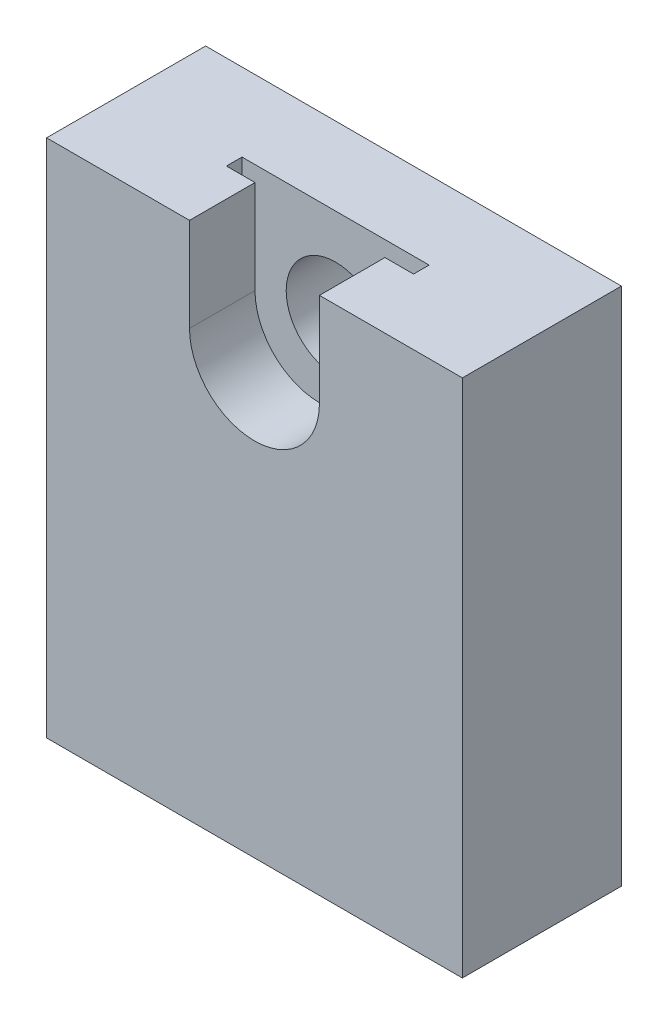
ISO-10303-21;
HEADER;
FILE_DESCRIPTION(('STEP AP214'),'2;1');
FILE_NAME('part.step','',(''),(''),'','','');
FILE_SCHEMA(('AUTOMOTIVE_DESIGN { 1 0 10303 214 1 1 1 1 }'));
ENDSEC;
DATA;
#1=APPLICATION_CONTEXT('core data for automotive mechanical design processes');
#2=APPLICATION_PROTOCOL_DEFINITION('international standard','automotive_design',2000,#1);
#3=PRODUCT_CONTEXT('',#1,'mechanical');
#4=PRODUCT('Part','Part','',(#3));
#5=PRODUCT_RELATED_PRODUCT_CATEGORY('part','',(#4));
#6=PRODUCT_DEFINITION_FORMATION('','',#4);
#7=PRODUCT_DEFINITION_CONTEXT('part definition',#1,'design');
#8=PRODUCT_DEFINITION('design','',#6,#7);
#9=PRODUCT_DEFINITION_SHAPE('','',#8);
#10=(LENGTH_UNIT() NAMED_UNIT(*) SI_UNIT(.MILLI.,.METRE.));
#11=(NAMED_UNIT(*) PLANE_ANGLE_UNIT() SI_UNIT($,.RADIAN.));
#12=(NAMED_UNIT(*) SI_UNIT($,.STERADIAN.) SOLID_ANGLE_UNIT());
#13=UNCERTAINTY_MEASURE_WITH_UNIT(LENGTH_MEASURE(1.E-05),#10,'distance_accuracy_value','');
#14=(GEOMETRIC_REPRESENTATION_CONTEXT(3) GLOBAL_UNCERTAINTY_ASSIGNED_CONTEXT((#13)) GLOBAL_UNIT_ASSIGNED_CONTEXT((#10,
#11,#12)) REPRESENTATION_CONTEXT('',''));
#15=CARTESIAN_POINT('',(0.,0.,0.));
#16=DIRECTION('',(0.,0.,1.));
#17=DIRECTION('',(1.,0.,0.));
#18=AXIS2_PLACEMENT_3D('',#15,#16,#17);
#19=CARTESIAN_POINT('',(20.,9.,-15.3));
#20=DIRECTION('',(0.,1.,0.));
#21=DIRECTION('',(-1.,0.,0.));
#22=AXIS2_PLACEMENT_3D('',#19,#20,#21);
#23=PLANE('',#22);
#24=DIRECTION('',(0.,0.,1.));
#25=VECTOR('',#24,1.);
#26=CARTESIAN_POINT('',(-9.,9.,-7.8));
#27=LINE('',#26,#25);
#28=CARTESIAN_POINT('',(-9.,9.,-7.8));
#29=VERTEX_POINT('',#28);
#30=CARTESIAN_POINT('',(-9.,9.,-6.3));
#31=VERTEX_POINT('',#30);
#32=EDGE_CURVE('E172',#29,#31,#27,.T.);
#33=ORIENTED_EDGE('',*,*,#32,.F.);
#34=DIRECTION('',(1.,0.,0.));
#35=VECTOR('',#34,1.);
#36=CARTESIAN_POINT('',(20.,9.,-7.8));
#37=LINE('',#36,#35);
#38=CARTESIAN_POINT('',(9.,9.,-7.8));
#39=VERTEX_POINT('',#38);
#40=EDGE_CURVE('E177',#29,#39,#37,.T.);
#41=ORIENTED_EDGE('',*,*,#40,.T.);
#42=DIRECTION('',(0.,0.,1.));
#43=VECTOR('',#42,1.);
#44=CARTESIAN_POINT('',(9.,9.,-7.8));
#45=LINE('',#44,#43);
#46=CARTESIAN_POINT('',(9.,9.,-6.3));
#47=VERTEX_POINT('',#46);
#48=EDGE_CURVE('E147',#39,#47,#45,.T.);
#49=ORIENTED_EDGE('',*,*,#48,.T.);
#50=DIRECTION('',(1.,0.,0.));
#51=VECTOR('',#50,1.);
#52=CARTESIAN_POINT('',(20.,9.,-6.3));
#53=LINE('',#52,#51);
#54=CARTESIAN_POINT('',(6.25,9.,-6.3));
#55=VERTEX_POINT('',#54);
#56=EDGE_CURVE('E171',#55,#47,#53,.T.);
#57=ORIENTED_EDGE('',*,*,#56,.F.);
#58=DIRECTION('',(0.,0.,1.));
#59=VECTOR('',#58,1.);
#60=CARTESIAN_POINT('',(6.25,9.,-15.3));
#61=LINE('',#60,#59);
#62=CARTESIAN_POINT('',(6.25,9.,0.));
#63=VERTEX_POINT('',#62);
#64=EDGE_CURVE('E224',#55,#63,#61,.T.);
#65=ORIENTED_EDGE('',*,*,#64,.T.);
#66=DIRECTION('',(-1.,0.,0.));
#67=VECTOR('',#66,1.);
#68=CARTESIAN_POINT('',(20.,9.,0.));
#69=LINE('',#68,#67);
#70=CARTESIAN_POINT('',(20.,9.,0.));
#71=VERTEX_POINT('',#70);
#72=EDGE_CURVE('E210',#71,#63,#69,.T.);
#73=ORIENTED_EDGE('',*,*,#72,.F.);
#74=DIRECTION('',(0.,0.,1.));
#75=VECTOR('',#74,1.);
#76=CARTESIAN_POINT('',(20.,9.,-15.3));
#77=LINE('',#76,#75);
#78=CARTESIAN_POINT('',(20.,9.,-15.3));
#79=VERTEX_POINT('',#78);
#80=EDGE_CURVE('E226',#79,#71,#77,.T.);
#81=ORIENTED_EDGE('',*,*,#80,.F.);
#82=DIRECTION('',(-1.,0.,0.));
#83=VECTOR('',#82,1.);
#84=CARTESIAN_POINT('',(-6.25,9.,-15.3));
#85=LINE('',#84,#83);
#86=CARTESIAN_POINT('',(-20.,9.,-15.3));
#87=VERTEX_POINT('',#86);
#88=EDGE_CURVE('E61',#79,#87,#85,.T.);
#89=ORIENTED_EDGE('',*,*,#88,.T.);
#90=DIRECTION('',(0.,0.,1.));
#91=VECTOR('',#90,1.);
#92=CARTESIAN_POINT('',(-20.,9.,-15.3));
#93=LINE('',#92,#91);
#94=CARTESIAN_POINT('',(-20.,9.,0.));
#95=VERTEX_POINT('',#94);
#96=EDGE_CURVE('E101',#87,#95,#93,.T.);
#97=ORIENTED_EDGE('',*,*,#96,.T.);
#98=DIRECTION('',(-1.,0.,0.));
#99=VECTOR('',#98,1.);
#100=CARTESIAN_POINT('',(-6.25,9.,0.));
#101=LINE('',#100,#99);
#102=CARTESIAN_POINT('',(-6.25,9.,0.));
#103=VERTEX_POINT('',#102);
#104=EDGE_CURVE('E188',#103,#95,#101,.T.);
#105=ORIENTED_EDGE('',*,*,#104,.F.);
#106=DIRECTION('',(0.,0.,1.));
#107=VECTOR('',#106,1.);
#108=CARTESIAN_POINT('',(-6.25,9.,-15.3));
#109=LINE('',#108,#107);
#110=CARTESIAN_POINT('',(-6.25,9.,-6.3));
#111=VERTEX_POINT('',#110);
#112=EDGE_CURVE('E11',#111,#103,#109,.T.);
#113=ORIENTED_EDGE('',*,*,#112,.F.);
#114=EDGE_CURVE('E176',#31,#111,#53,.T.);
#115=ORIENTED_EDGE('',*,*,#114,.F.);
#116=EDGE_LOOP('',(#33,#41,#49,#57,#65,#73,#81,#89,#97,#105,#113,#115));
#117=FACE_BOUND('',#116,.T.);
#118=ADVANCED_FACE('F35',(#117),#23,.T.);
#119=CARTESIAN_POINT('',(0.,0.,-6.3));
#120=DIRECTION('',(0.,0.,-1.));
#121=DIRECTION('',(-1.,0.,0.));
#122=AXIS2_PLACEMENT_3D('',#119,#120,#121);
#123=CYLINDRICAL_SURFACE('',#122,4.75);
#124=CARTESIAN_POINT('',(0.,0.,-15.3));
#125=DIRECTION('',(0.,0.,-1.));
#126=DIRECTION('',(-1.,0.,0.));
#127=AXIS2_PLACEMENT_3D('',#124,#125,#126);
#128=CIRCLE('',#127,4.75);
#129=CARTESIAN_POINT('',(-4.75,0.,-15.3));
#130=VERTEX_POINT('',#129);
#131=EDGE_CURVE('E179',#130,#130,#128,.T.);
#132=ORIENTED_EDGE('',*,*,#131,.T.);
#133=EDGE_LOOP('',(#132));
#134=FACE_BOUND('',#133,.T.);
#135=CARTESIAN_POINT('',(0.,0.,-7.8));
#136=DIRECTION('',(0.,0.,1.));
#137=DIRECTION('',(1.,0.,0.));
#138=AXIS2_PLACEMENT_3D('',#135,#136,#137);
#139=CIRCLE('',#138,4.75);
#140=CARTESIAN_POINT('',(4.75,0.,-7.8));
#141=VERTEX_POINT('',#140);
#142=EDGE_CURVE('E39',#141,#141,#139,.F.);
#143=ORIENTED_EDGE('',*,*,#142,.F.);
#144=EDGE_LOOP('',(#143));
#145=FACE_BOUND('',#144,.T.);
#146=ADVANCED_FACE('F255',(#134,#145),#123,.F.);
#147=CARTESIAN_POINT('',(-6.25,0.,-15.3));
#148=DIRECTION('',(1.,0.,0.));
#149=DIRECTION('',(0.,0.,-1.));
#150=AXIS2_PLACEMENT_3D('',#147,#148,#149);
#151=PLANE('',#150);
#152=DIRECTION('',(0.,0.,1.));
#153=VECTOR('',#152,1.);
#154=CARTESIAN_POINT('',(-6.25,0.,-15.3));
#155=LINE('',#154,#153);
#156=CARTESIAN_POINT('',(-6.25,0.,-6.3));
#157=VERTEX_POINT('',#156);
#158=CARTESIAN_POINT('',(-6.25,0.,0.));
#159=VERTEX_POINT('',#158);
#160=EDGE_CURVE('E44',#157,#159,#155,.T.);
#161=ORIENTED_EDGE('',*,*,#160,.F.);
#162=DIRECTION('',(0.,1.,0.));
#163=VECTOR('',#162,1.);
#164=CARTESIAN_POINT('',(-6.25,0.,-6.3));
#165=LINE('',#164,#163);
#166=EDGE_CURVE('E185',#157,#111,#165,.T.);
#167=ORIENTED_EDGE('',*,*,#166,.T.);
#168=ORIENTED_EDGE('',*,*,#112,.T.);
#169=DIRECTION('',(0.,1.,0.));
#170=VECTOR('',#169,1.);
#171=CARTESIAN_POINT('',(-6.25,0.,0.));
#172=LINE('',#171,#170);
#173=EDGE_CURVE('E191',#159,#103,#172,.T.);
#174=ORIENTED_EDGE('',*,*,#173,.F.);
#175=EDGE_LOOP('',(#161,#167,#168,#174));
#176=FACE_BOUND('',#175,.T.);
#177=ADVANCED_FACE('F238',(#176),#151,.T.);
#178=CARTESIAN_POINT('',(0.,0.,-15.3));
#179=DIRECTION('',(0.,0.,1.));
#180=DIRECTION('',(1.,0.,0.));
#181=AXIS2_PLACEMENT_3D('',#178,#179,#180);
#182=CYLINDRICAL_SURFACE('',#181,6.25);
#183=DIRECTION('',(0.,0.,1.));
#184=VECTOR('',#183,1.);
#185=CARTESIAN_POINT('',(6.25,0.,-15.3));
#186=LINE('',#185,#184);
#187=CARTESIAN_POINT('',(6.25,0.,-6.3));
#188=VERTEX_POINT('',#187);
#189=CARTESIAN_POINT('',(6.25,0.,0.));
#190=VERTEX_POINT('',#189);
#191=EDGE_CURVE('E222',#188,#190,#186,.T.);
#192=ORIENTED_EDGE('',*,*,#191,.F.);
#193=CARTESIAN_POINT('',(0.,0.,-6.3));
#194=DIRECTION('',(0.,0.,-1.));
#195=DIRECTION('',(-1.,0.,0.));
#196=AXIS2_PLACEMENT_3D('',#193,#194,#195);
#197=CIRCLE('',#196,6.25);
#198=EDGE_CURVE('E182',#188,#157,#197,.T.);
#199=ORIENTED_EDGE('',*,*,#198,.T.);
#200=ORIENTED_EDGE('',*,*,#160,.T.);
#201=CARTESIAN_POINT('',(0.,0.,0.));
#202=DIRECTION('',(0.,0.,-1.));
#203=DIRECTION('',(-1.,0.,0.));
#204=AXIS2_PLACEMENT_3D('',#201,#202,#203);
#205=CIRCLE('',#204,6.25);
#206=EDGE_CURVE('E216',#190,#159,#205,.T.);
#207=ORIENTED_EDGE('',*,*,#206,.F.);
#208=EDGE_LOOP('',(#192,#199,#200,#207));
#209=FACE_BOUND('',#208,.T.);
#210=ADVANCED_FACE('F241',(#209),#182,.F.);
#211=CARTESIAN_POINT('',(6.25,9.,-15.3));
#212=DIRECTION('',(-1.,0.,0.));
#213=DIRECTION('',(0.,-1.,0.));
#214=AXIS2_PLACEMENT_3D('',#211,#212,#213);
#215=PLANE('',#214);
#216=ORIENTED_EDGE('',*,*,#64,.F.);
#217=DIRECTION('',(0.,-1.,0.));
#218=VECTOR('',#217,1.);
#219=CARTESIAN_POINT('',(6.25,9.,-6.3));
#220=LINE('',#219,#218);
#221=EDGE_CURVE('E52',#55,#188,#220,.T.);
#222=ORIENTED_EDGE('',*,*,#221,.T.);
#223=ORIENTED_EDGE('',*,*,#191,.T.);
#224=DIRECTION('',(0.,-1.,0.));
#225=VECTOR('',#224,1.);
#226=CARTESIAN_POINT('',(6.25,9.,0.));
#227=LINE('',#226,#225);
#228=EDGE_CURVE('E213',#63,#190,#227,.T.);
#229=ORIENTED_EDGE('',*,*,#228,.F.);
#230=EDGE_LOOP('',(#216,#222,#223,#229));
#231=FACE_BOUND('',#230,.T.);
#232=ADVANCED_FACE('F245',(#231),#215,.T.);
#233=CARTESIAN_POINT('',(20.,-41.,-15.3));
#234=DIRECTION('',(1.,0.,0.));
#235=DIRECTION('',(0.,0.,-1.));
#236=AXIS2_PLACEMENT_3D('',#233,#234,#235);
#237=PLANE('',#236);
#238=DIRECTION('',(0.,1.,0.));
#239=VECTOR('',#238,1.);
#240=CARTESIAN_POINT('',(20.,-41.,0.));
#241=LINE('',#240,#239);
#242=CARTESIAN_POINT('',(20.,-41.,0.));
#243=VERTEX_POINT('',#242);
#244=EDGE_CURVE('E207',#243,#71,#241,.T.);
#245=ORIENTED_EDGE('',*,*,#244,.F.);
#246=DIRECTION('',(0.,0.,1.));
#247=VECTOR('',#246,1.);
#248=CARTESIAN_POINT('',(20.,-41.,-15.3));
#249=LINE('',#248,#247);
#250=CARTESIAN_POINT('',(20.,-41.,-15.3));
#251=VERTEX_POINT('',#250);
#252=EDGE_CURVE('E228',#251,#243,#249,.T.);
#253=ORIENTED_EDGE('',*,*,#252,.F.);
#254=DIRECTION('',(0.,1.,0.));
#255=VECTOR('',#254,1.);
#256=CARTESIAN_POINT('',(20.,-41.,-15.3));
#257=LINE('',#256,#255);
#258=EDGE_CURVE('E196',#251,#79,#257,.T.);
#259=ORIENTED_EDGE('',*,*,#258,.T.);
#260=ORIENTED_EDGE('',*,*,#80,.T.);
#261=EDGE_LOOP('',(#245,#253,#259,#260));
#262=FACE_BOUND('',#261,.T.);
#263=ADVANCED_FACE('F276',(#262),#237,.T.);
#264=CARTESIAN_POINT('',(-20.,-41.,-15.3));
#265=DIRECTION('',(0.,-1.,0.));
#266=DIRECTION('',(0.,0.,-1.));
#267=AXIS2_PLACEMENT_3D('',#264,#265,#266);
#268=PLANE('',#267);
#269=DIRECTION('',(1.,0.,0.));
#270=VECTOR('',#269,1.);
#271=CARTESIAN_POINT('',(-20.,-41.,0.));
#272=LINE('',#271,#270);
#273=CARTESIAN_POINT('',(-20.,-41.,0.));
#274=VERTEX_POINT('',#273);
#275=EDGE_CURVE('E204',#274,#243,#272,.T.);
#276=ORIENTED_EDGE('',*,*,#275,.F.);
#277=DIRECTION('',(0.,0.,1.));
#278=VECTOR('',#277,1.);
#279=CARTESIAN_POINT('',(-20.,-41.,-15.3));
#280=LINE('',#279,#278);
#281=CARTESIAN_POINT('',(-20.,-41.,-15.3));
#282=VERTEX_POINT('',#281);
#283=EDGE_CURVE('E230',#282,#274,#280,.T.);
#284=ORIENTED_EDGE('',*,*,#283,.F.);
#285=DIRECTION('',(1.,0.,0.));
#286=VECTOR('',#285,1.);
#287=CARTESIAN_POINT('',(-20.,-41.,-15.3));
#288=LINE('',#287,#286);
#289=EDGE_CURVE('E193',#282,#251,#288,.T.);
#290=ORIENTED_EDGE('',*,*,#289,.T.);
#291=ORIENTED_EDGE('',*,*,#252,.T.);
#292=EDGE_LOOP('',(#276,#284,#290,#291));
#293=FACE_BOUND('',#292,.T.);
#294=ADVANCED_FACE('F279',(#293),#268,.T.);
#295=CARTESIAN_POINT('',(-20.,9.,-15.3));
#296=DIRECTION('',(-1.,0.,0.));
#297=DIRECTION('',(0.,-1.,0.));
#298=AXIS2_PLACEMENT_3D('',#295,#296,#297);
#299=PLANE('',#298);
#300=DIRECTION('',(0.,-1.,0.));
#301=VECTOR('',#300,1.);
#302=CARTESIAN_POINT('',(-20.,9.,0.));
#303=LINE('',#302,#301);
#304=EDGE_CURVE('E201',#95,#274,#303,.T.);
#305=ORIENTED_EDGE('',*,*,#304,.F.);
#306=ORIENTED_EDGE('',*,*,#96,.F.);
#307=DIRECTION('',(0.,-1.,0.));
#308=VECTOR('',#307,1.);
#309=CARTESIAN_POINT('',(-20.,9.,-15.3));
#310=LINE('',#309,#308);
#311=EDGE_CURVE('E190',#87,#282,#310,.T.);
#312=ORIENTED_EDGE('',*,*,#311,.T.);
#313=ORIENTED_EDGE('',*,*,#283,.T.);
#314=EDGE_LOOP('',(#305,#306,#312,#313));
#315=FACE_BOUND('',#314,.T.);
#316=ADVANCED_FACE('F37',(#315),#299,.T.);
#317=CARTESIAN_POINT('',(0.,0.,-15.3));
#318=DIRECTION('',(0.,0.,-1.));
#319=DIRECTION('',(-1.,0.,0.));
#320=AXIS2_PLACEMENT_3D('',#317,#318,#319);
#321=PLANE('',#320);
#322=ORIENTED_EDGE('',*,*,#88,.F.);
#323=ORIENTED_EDGE('',*,*,#258,.F.);
#324=ORIENTED_EDGE('',*,*,#289,.F.);
#325=ORIENTED_EDGE('',*,*,#311,.F.);
#326=EDGE_LOOP('',(#322,#323,#324,#325));
#327=FACE_BOUND('',#326,.T.);
#328=ORIENTED_EDGE('',*,*,#131,.F.);
#329=EDGE_LOOP('',(#328));
#330=FACE_BOUND('',#329,.T.);
#331=ADVANCED_FACE('F268',(#327,#330),#321,.T.);
#332=CARTESIAN_POINT('',(0.,0.,0.));
#333=DIRECTION('',(0.,0.,-1.));
#334=DIRECTION('',(-1.,0.,0.));
#335=AXIS2_PLACEMENT_3D('',#332,#333,#334);
#336=PLANE('',#335);
#337=ORIENTED_EDGE('',*,*,#104,.T.);
#338=ORIENTED_EDGE('',*,*,#304,.T.);
#339=ORIENTED_EDGE('',*,*,#275,.T.);
#340=ORIENTED_EDGE('',*,*,#244,.T.);
#341=ORIENTED_EDGE('',*,*,#72,.T.);
#342=ORIENTED_EDGE('',*,*,#228,.T.);
#343=ORIENTED_EDGE('',*,*,#206,.T.);
#344=ORIENTED_EDGE('',*,*,#173,.T.);
#345=EDGE_LOOP('',(#337,#338,#339,#340,#341,#342,#343,#344));
#346=FACE_BOUND('',#345,.T.);
#347=ADVANCED_FACE('F235',(#346),#336,.F.);
#348=CARTESIAN_POINT('',(0.,0.,-7.8));
#349=DIRECTION('',(0.,0.,1.));
#350=DIRECTION('',(1.,0.,0.));
#351=AXIS2_PLACEMENT_3D('',#348,#349,#350);
#352=PLANE('',#351);
#353=DIRECTION('',(0.,-1.,0.));
#354=VECTOR('',#353,1.);
#355=CARTESIAN_POINT('',(-9.,0.,-7.8));
#356=LINE('',#355,#354);
#357=CARTESIAN_POINT('',(-9.,0.,-7.8));
#358=VERTEX_POINT('',#357);
#359=EDGE_CURVE('E148',#29,#358,#356,.T.);
#360=ORIENTED_EDGE('',*,*,#359,.T.);
#361=CARTESIAN_POINT('',(0.,0.,-7.8));
#362=DIRECTION('',(0.,0.,1.));
#363=DIRECTION('',(1.,0.,0.));
#364=AXIS2_PLACEMENT_3D('',#361,#362,#363);
#365=CIRCLE('',#364,9.);
#366=CARTESIAN_POINT('',(9.,0.,-7.8));
#367=VERTEX_POINT('',#366);
#368=EDGE_CURVE('E140',#358,#367,#365,.T.);
#369=ORIENTED_EDGE('',*,*,#368,.T.);
#370=DIRECTION('',(0.,1.,0.));
#371=VECTOR('',#370,1.);
#372=CARTESIAN_POINT('',(9.,0.,-7.8));
#373=LINE('',#372,#371);
#374=EDGE_CURVE('E151',#367,#39,#373,.T.);
#375=ORIENTED_EDGE('',*,*,#374,.T.);
#376=ORIENTED_EDGE('',*,*,#40,.F.);
#377=EDGE_LOOP('',(#360,#369,#375,#376));
#378=FACE_BOUND('',#377,.T.);
#379=ORIENTED_EDGE('',*,*,#142,.T.);
#380=EDGE_LOOP('',(#379));
#381=FACE_BOUND('',#380,.T.);
#382=ADVANCED_FACE('F157',(#378,#381),#352,.T.);
#383=CARTESIAN_POINT('',(0.,0.,-6.3));
#384=DIRECTION('',(0.,0.,1.));
#385=DIRECTION('',(1.,0.,0.));
#386=AXIS2_PLACEMENT_3D('',#383,#384,#385);
#387=PLANE('',#386);
#388=ORIENTED_EDGE('',*,*,#166,.F.);
#389=ORIENTED_EDGE('',*,*,#198,.F.);
#390=ORIENTED_EDGE('',*,*,#221,.F.);
#391=ORIENTED_EDGE('',*,*,#56,.T.);
#392=DIRECTION('',(0.,1.,0.));
#393=VECTOR('',#392,1.);
#394=CARTESIAN_POINT('',(9.,0.,-6.3));
#395=LINE('',#394,#393);
#396=CARTESIAN_POINT('',(9.,0.,-6.3));
#397=VERTEX_POINT('',#396);
#398=EDGE_CURVE('E163',#397,#47,#395,.T.);
#399=ORIENTED_EDGE('',*,*,#398,.F.);
#400=CARTESIAN_POINT('',(0.,0.,-6.3));
#401=DIRECTION('',(0.,0.,1.));
#402=DIRECTION('',(1.,0.,0.));
#403=AXIS2_PLACEMENT_3D('',#400,#401,#402);
#404=CIRCLE('',#403,9.);
#405=CARTESIAN_POINT('',(-9.,0.,-6.3));
#406=VERTEX_POINT('',#405);
#407=EDGE_CURVE('E143',#406,#397,#404,.T.);
#408=ORIENTED_EDGE('',*,*,#407,.F.);
#409=DIRECTION('',(0.,-1.,0.));
#410=VECTOR('',#409,1.);
#411=CARTESIAN_POINT('',(-9.,0.,-6.3));
#412=LINE('',#411,#410);
#413=EDGE_CURVE('E160',#31,#406,#412,.T.);
#414=ORIENTED_EDGE('',*,*,#413,.F.);
#415=ORIENTED_EDGE('',*,*,#114,.T.);
#416=EDGE_LOOP('',(#388,#389,#390,#391,#399,#408,#414,#415));
#417=FACE_BOUND('',#416,.T.);
#418=ADVANCED_FACE('F242',(#417),#387,.F.);
#419=CARTESIAN_POINT('',(0.,0.,-7.8));
#420=DIRECTION('',(0.,0.,1.));
#421=DIRECTION('',(1.,0.,0.));
#422=AXIS2_PLACEMENT_3D('',#419,#420,#421);
#423=CYLINDRICAL_SURFACE('',#422,9.);
#424=ORIENTED_EDGE('',*,*,#407,.T.);
#425=DIRECTION('',(0.,0.,1.));
#426=VECTOR('',#425,1.);
#427=CARTESIAN_POINT('',(9.,0.,-7.8));
#428=LINE('',#427,#426);
#429=EDGE_CURVE('E136',#367,#397,#428,.T.);
#430=ORIENTED_EDGE('',*,*,#429,.F.);
#431=ORIENTED_EDGE('',*,*,#368,.F.);
#432=DIRECTION('',(0.,0.,1.));
#433=VECTOR('',#432,1.);
#434=CARTESIAN_POINT('',(-9.,0.,-7.8));
#435=LINE('',#434,#433);
#436=EDGE_CURVE('E169',#358,#406,#435,.T.);
#437=ORIENTED_EDGE('',*,*,#436,.T.);
#438=EDGE_LOOP('',(#424,#430,#431,#437));
#439=FACE_BOUND('',#438,.T.);
#440=ADVANCED_FACE('F138',(#439),#423,.F.);
#441=CARTESIAN_POINT('',(-9.,0.,-7.8));
#442=DIRECTION('',(-1.,0.,0.));
#443=DIRECTION('',(0.,-1.,0.));
#444=AXIS2_PLACEMENT_3D('',#441,#442,#443);
#445=PLANE('',#444);
#446=ORIENTED_EDGE('',*,*,#413,.T.);
#447=ORIENTED_EDGE('',*,*,#436,.F.);
#448=ORIENTED_EDGE('',*,*,#359,.F.);
#449=ORIENTED_EDGE('',*,*,#32,.T.);
#450=EDGE_LOOP('',(#446,#447,#448,#449));
#451=FACE_BOUND('',#450,.T.);
#452=ADVANCED_FACE('F251',(#451),#445,.F.);
#453=CARTESIAN_POINT('',(9.,0.,-7.8));
#454=DIRECTION('',(1.,0.,0.));
#455=DIRECTION('',(0.,1.,0.));
#456=AXIS2_PLACEMENT_3D('',#453,#454,#455);
#457=PLANE('',#456);
#458=ORIENTED_EDGE('',*,*,#398,.T.);
#459=ORIENTED_EDGE('',*,*,#48,.F.);
#460=ORIENTED_EDGE('',*,*,#374,.F.);
#461=ORIENTED_EDGE('',*,*,#429,.T.);
#462=EDGE_LOOP('',(#458,#459,#460,#461));
#463=FACE_BOUND('',#462,.T.);
#464=ADVANCED_FACE('F152',(#463),#457,.F.);
#465=CLOSED_SHELL('',(#118,#146,#177,#210,#232,#263,#294,#316,#331,#347,#382,#418,#440,#452,#464));
#466=MANIFOLD_SOLID_BREP('B2',#465);
#467=ADVANCED_BREP_SHAPE_REPRESENTATION('',(#18,#466),#14);
#468=SHAPE_DEFINITION_REPRESENTATION(#9,#467);
ENDSEC;
END-ISO-10303-21;
